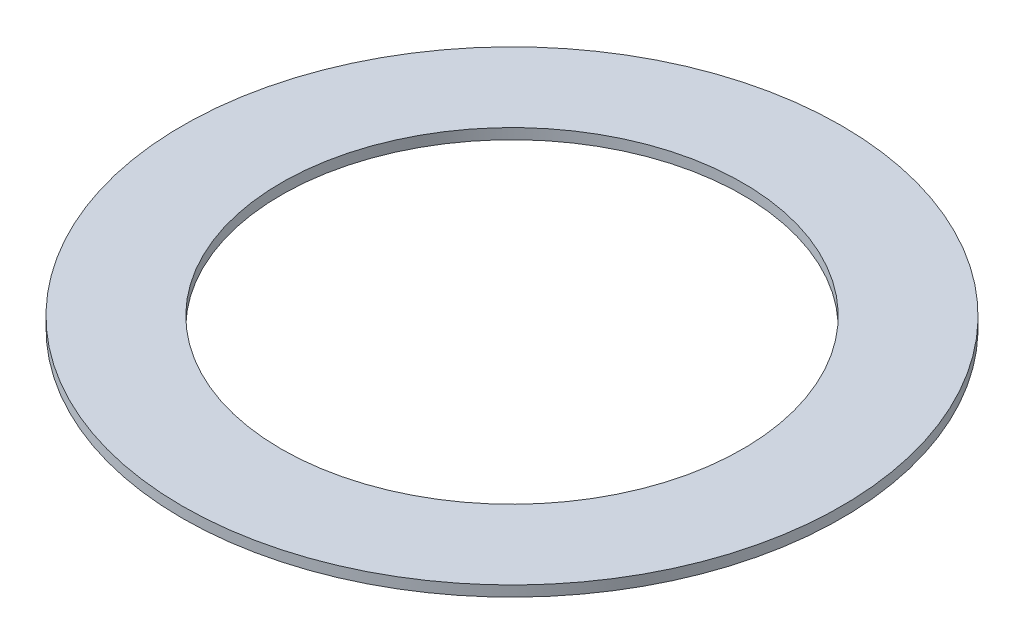
ISO-10303-21;
HEADER;
FILE_DESCRIPTION(('STEP AP214'),'2;1');
FILE_NAME('part.step','',(''),(''),'','','');
FILE_SCHEMA(('AUTOMOTIVE_DESIGN { 1 0 10303 214 1 1 1 1 }'));
ENDSEC;
DATA;
#1=APPLICATION_CONTEXT('core data for automotive mechanical design processes');
#2=APPLICATION_PROTOCOL_DEFINITION('international standard','automotive_design',2000,#1);
#3=PRODUCT_CONTEXT('',#1,'mechanical');
#4=PRODUCT('Part','Part','',(#3));
#5=PRODUCT_RELATED_PRODUCT_CATEGORY('part','',(#4));
#6=PRODUCT_DEFINITION_FORMATION('','',#4);
#7=PRODUCT_DEFINITION_CONTEXT('part definition',#1,'design');
#8=PRODUCT_DEFINITION('design','',#6,#7);
#9=PRODUCT_DEFINITION_SHAPE('','',#8);
#10=(LENGTH_UNIT() NAMED_UNIT(*) SI_UNIT(.MILLI.,.METRE.));
#11=(NAMED_UNIT(*) PLANE_ANGLE_UNIT() SI_UNIT($,.RADIAN.));
#12=(NAMED_UNIT(*) SI_UNIT($,.STERADIAN.) SOLID_ANGLE_UNIT());
#13=UNCERTAINTY_MEASURE_WITH_UNIT(LENGTH_MEASURE(1.E-05),#10,'distance_accuracy_value','');
#14=(GEOMETRIC_REPRESENTATION_CONTEXT(3) GLOBAL_UNCERTAINTY_ASSIGNED_CONTEXT((#13)) GLOBAL_UNIT_ASSIGNED_CONTEXT((#10,
#11,#12)) REPRESENTATION_CONTEXT('',''));
#15=CARTESIAN_POINT('',(0.,0.,0.));
#16=DIRECTION('',(0.,0.,1.));
#17=DIRECTION('',(1.,0.,0.));
#18=AXIS2_PLACEMENT_3D('',#15,#16,#17);
#19=CARTESIAN_POINT('',(0.,0.508,0.));
#20=DIRECTION('',(0.,1.,0.));
#21=DIRECTION('',(0.,0.,1.));
#22=AXIS2_PLACEMENT_3D('',#19,#20,#21);
#23=PLANE('',#22);
#24=CARTESIAN_POINT('',(0.,0.508,0.));
#25=DIRECTION('',(0.,1.,0.));
#26=DIRECTION('',(0.,0.,1.));
#27=AXIS2_PLACEMENT_3D('',#24,#25,#26);
#28=CIRCLE('',#27,15.875);
#29=CARTESIAN_POINT('',(0.,0.508,15.875));
#30=VERTEX_POINT('',#29);
#31=EDGE_CURVE('E10',#30,#30,#28,.T.);
#32=ORIENTED_EDGE('',*,*,#31,.T.);
#33=EDGE_LOOP('',(#32));
#34=FACE_BOUND('',#33,.T.);
#35=CARTESIAN_POINT('',(0.,0.508,0.));
#36=DIRECTION('',(0.,1.,0.));
#37=DIRECTION('',(0.,0.,1.));
#38=AXIS2_PLACEMENT_3D('',#35,#36,#37);
#39=CIRCLE('',#38,11.1125);
#40=CARTESIAN_POINT('',(0.,0.508,11.1125));
#41=VERTEX_POINT('',#40);
#42=EDGE_CURVE('E52',#41,#41,#39,.T.);
#43=ORIENTED_EDGE('',*,*,#42,.F.);
#44=EDGE_LOOP('',(#43));
#45=FACE_BOUND('',#44,.T.);
#46=ADVANCED_FACE('F41',(#34,#45),#23,.T.);
#47=CARTESIAN_POINT('',(0.,0.,0.));
#48=DIRECTION('',(0.,1.,0.));
#49=DIRECTION('',(0.,0.,1.));
#50=AXIS2_PLACEMENT_3D('',#47,#48,#49);
#51=PLANE('',#50);
#52=CARTESIAN_POINT('',(0.,0.,0.));
#53=DIRECTION('',(0.,1.,0.));
#54=DIRECTION('',(0.,0.,1.));
#55=AXIS2_PLACEMENT_3D('',#52,#53,#54);
#56=CIRCLE('',#55,15.875);
#57=CARTESIAN_POINT('',(0.,0.,15.875));
#58=VERTEX_POINT('',#57);
#59=EDGE_CURVE('E45',#58,#58,#56,.T.);
#60=ORIENTED_EDGE('',*,*,#59,.F.);
#61=EDGE_LOOP('',(#60));
#62=FACE_BOUND('',#61,.T.);
#63=CARTESIAN_POINT('',(0.,0.,0.));
#64=DIRECTION('',(0.,1.,0.));
#65=DIRECTION('',(0.,0.,1.));
#66=AXIS2_PLACEMENT_3D('',#63,#64,#65);
#67=CIRCLE('',#66,11.1125);
#68=CARTESIAN_POINT('',(0.,0.,11.1125));
#69=VERTEX_POINT('',#68);
#70=EDGE_CURVE('E54',#69,#69,#67,.T.);
#71=ORIENTED_EDGE('',*,*,#70,.T.);
#72=EDGE_LOOP('',(#71));
#73=FACE_BOUND('',#72,.T.);
#74=ADVANCED_FACE('F64',(#62,#73),#51,.F.);
#75=CARTESIAN_POINT('',(0.,0.508,0.));
#76=DIRECTION('',(0.,-1.,0.));
#77=DIRECTION('',(0.,0.,-1.));
#78=AXIS2_PLACEMENT_3D('',#75,#76,#77);
#79=CYLINDRICAL_SURFACE('',#78,15.875);
#80=ORIENTED_EDGE('',*,*,#31,.F.);
#81=EDGE_LOOP('',(#80));
#82=FACE_BOUND('',#81,.T.);
#83=ORIENTED_EDGE('',*,*,#59,.T.);
#84=EDGE_LOOP('',(#83));
#85=FACE_BOUND('',#84,.T.);
#86=ADVANCED_FACE('F43',(#82,#85),#79,.T.);
#87=CARTESIAN_POINT('',(0.,0.508,0.));
#88=DIRECTION('',(0.,-1.,0.));
#89=DIRECTION('',(0.,0.,-1.));
#90=AXIS2_PLACEMENT_3D('',#87,#88,#89);
#91=CYLINDRICAL_SURFACE('',#90,11.1125);
#92=ORIENTED_EDGE('',*,*,#42,.T.);
#93=EDGE_LOOP('',(#92));
#94=FACE_BOUND('',#93,.T.);
#95=ORIENTED_EDGE('',*,*,#70,.F.);
#96=EDGE_LOOP('',(#95));
#97=FACE_BOUND('',#96,.T.);
#98=ADVANCED_FACE('F60',(#94,#97),#91,.F.);
#99=CLOSED_SHELL('',(#46,#74,#86,#98));
#100=MANIFOLD_SOLID_BREP('B2',#99);
#101=ADVANCED_BREP_SHAPE_REPRESENTATION('',(#18,#100),#14);
#102=SHAPE_DEFINITION_REPRESENTATION(#9,#101);
ENDSEC;
END-ISO-10303-21;
